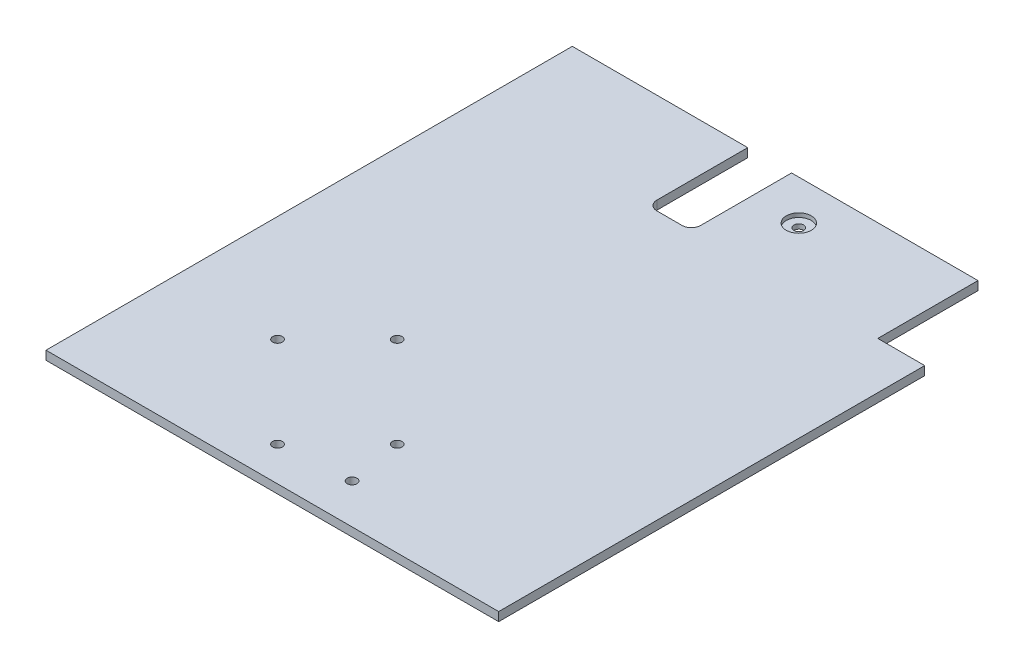
ISO-10303-21;
HEADER;
FILE_DESCRIPTION(('STEP AP214'),'2;1');
FILE_NAME('part.step','',(''),(''),'','','');
FILE_SCHEMA(('AUTOMOTIVE_DESIGN { 1 0 10303 214 1 1 1 1 }'));
ENDSEC;
DATA;
#1=APPLICATION_CONTEXT('core data for automotive mechanical design processes');
#2=APPLICATION_PROTOCOL_DEFINITION('international standard','automotive_design',2000,#1);
#3=PRODUCT_CONTEXT('',#1,'mechanical');
#4=PRODUCT('Part','Part','',(#3));
#5=PRODUCT_RELATED_PRODUCT_CATEGORY('part','',(#4));
#6=PRODUCT_DEFINITION_FORMATION('','',#4);
#7=PRODUCT_DEFINITION_CONTEXT('part definition',#1,'design');
#8=PRODUCT_DEFINITION('design','',#6,#7);
#9=PRODUCT_DEFINITION_SHAPE('','',#8);
#10=(LENGTH_UNIT() NAMED_UNIT(*) SI_UNIT(.MILLI.,.METRE.));
#11=(NAMED_UNIT(*) PLANE_ANGLE_UNIT() SI_UNIT($,.RADIAN.));
#12=(NAMED_UNIT(*) SI_UNIT($,.STERADIAN.) SOLID_ANGLE_UNIT());
#13=UNCERTAINTY_MEASURE_WITH_UNIT(LENGTH_MEASURE(1.E-05),#10,'distance_accuracy_value','');
#14=(GEOMETRIC_REPRESENTATION_CONTEXT(3) GLOBAL_UNCERTAINTY_ASSIGNED_CONTEXT((#13)) GLOBAL_UNIT_ASSIGNED_CONTEXT((#10,
#11,#12)) REPRESENTATION_CONTEXT('',''));
#15=CARTESIAN_POINT('',(0.,0.,0.));
#16=DIRECTION('',(0.,0.,1.));
#17=DIRECTION('',(1.,0.,0.));
#18=AXIS2_PLACEMENT_3D('',#15,#16,#17);
#19=CARTESIAN_POINT('',(-72.25,2.8,-84.));
#20=DIRECTION('',(0.,0.,1.));
#21=DIRECTION('',(1.,0.,0.));
#22=AXIS2_PLACEMENT_3D('',#19,#20,#21);
#23=PLANE('',#22);
#24=DIRECTION('',(-1.,0.,0.));
#25=VECTOR('',#24,1.);
#26=CARTESIAN_POINT('',(-72.25,0.,-84.));
#27=LINE('',#26,#25);
#28=CARTESIAN_POINT('',(57.25,0.,-84.));
#29=VERTEX_POINT('',#28);
#30=CARTESIAN_POINT('',(-2.24999999999999,0.,-84.));
#31=VERTEX_POINT('',#30);
#32=EDGE_CURVE('E141',#29,#31,#27,.T.);
#33=ORIENTED_EDGE('',*,*,#32,.T.);
#34=DIRECTION('',(0.,1.,0.));
#35=VECTOR('',#34,1.);
#36=CARTESIAN_POINT('',(-2.24999999999999,-0.00100000000000013,-84.));
#37=LINE('',#36,#35);
#38=CARTESIAN_POINT('',(-2.24999999999999,2.8,-84.));
#39=VERTEX_POINT('',#38);
#40=EDGE_CURVE('E121',#31,#39,#37,.T.);
#41=ORIENTED_EDGE('',*,*,#40,.T.);
#42=DIRECTION('',(-1.,0.,0.));
#43=VECTOR('',#42,1.);
#44=CARTESIAN_POINT('',(-72.25,2.8,-84.));
#45=LINE('',#44,#43);
#46=CARTESIAN_POINT('',(57.25,2.8,-84.));
#47=VERTEX_POINT('',#46);
#48=EDGE_CURVE('E213',#47,#39,#45,.T.);
#49=ORIENTED_EDGE('',*,*,#48,.F.);
#50=DIRECTION('',(0.,1.,0.));
#51=VECTOR('',#50,1.);
#52=CARTESIAN_POINT('',(57.25,-0.00100000000000013,-84.));
#53=LINE('',#52,#51);
#54=EDGE_CURVE('E147',#29,#47,#53,.T.);
#55=ORIENTED_EDGE('',*,*,#54,.F.);
#56=EDGE_LOOP('',(#33,#41,#49,#55));
#57=FACE_BOUND('',#56,.T.);
#58=ADVANCED_FACE('F32',(#57),#23,.F.);
#59=CARTESIAN_POINT('',(12.75,-0.00100000000000013,-71.3));
#60=DIRECTION('',(0.,1.,0.));
#61=DIRECTION('',(0.,0.,1.));
#62=AXIS2_PLACEMENT_3D('',#59,#60,#61);
#63=CYLINDRICAL_SURFACE('',#62,1.54999999999999);
#64=CARTESIAN_POINT('',(12.75,0.,-71.3));
#65=DIRECTION('',(0.,-1.,0.));
#66=DIRECTION('',(0.,0.,-1.));
#67=AXIS2_PLACEMENT_3D('',#64,#65,#66);
#68=CIRCLE('',#67,1.54999999999999);
#69=CARTESIAN_POINT('',(12.75,0.,-72.85));
#70=VERTEX_POINT('',#69);
#71=EDGE_CURVE('E197',#70,#70,#68,.F.);
#72=ORIENTED_EDGE('',*,*,#71,.F.);
#73=EDGE_LOOP('',(#72));
#74=FACE_BOUND('',#73,.T.);
#75=CARTESIAN_POINT('',(12.75,1.5,-71.3));
#76=DIRECTION('',(0.,1.,0.));
#77=DIRECTION('',(0.,0.,1.));
#78=AXIS2_PLACEMENT_3D('',#75,#76,#77);
#79=CIRCLE('',#78,1.54999999999999);
#80=CARTESIAN_POINT('',(12.75,1.5,-69.75));
#81=VERTEX_POINT('',#80);
#82=EDGE_CURVE('E36',#81,#81,#79,.F.);
#83=ORIENTED_EDGE('',*,*,#82,.F.);
#84=EDGE_LOOP('',(#83));
#85=FACE_BOUND('',#84,.T.);
#86=ADVANCED_FACE('F296',(#74,#85),#63,.F.);
#87=CARTESIAN_POINT('',(72.25,2.8,84.));
#88=DIRECTION('',(-1.,0.,0.));
#89=DIRECTION('',(0.,0.,1.));
#90=AXIS2_PLACEMENT_3D('',#87,#88,#89);
#91=PLANE('',#90);
#92=DIRECTION('',(0.,0.,-1.));
#93=VECTOR('',#92,1.);
#94=CARTESIAN_POINT('',(72.25,0.,84.));
#95=LINE('',#94,#93);
#96=CARTESIAN_POINT('',(72.25,0.,84.));
#97=VERTEX_POINT('',#96);
#98=CARTESIAN_POINT('',(72.25,0.,-52.));
#99=VERTEX_POINT('',#98);
#100=EDGE_CURVE('E153',#97,#99,#95,.T.);
#101=ORIENTED_EDGE('',*,*,#100,.T.);
#102=DIRECTION('',(0.,1.,0.));
#103=VECTOR('',#102,1.);
#104=CARTESIAN_POINT('',(72.25,-0.00100000000000013,-52.));
#105=LINE('',#104,#103);
#106=CARTESIAN_POINT('',(72.25,2.8,-52.));
#107=VERTEX_POINT('',#106);
#108=EDGE_CURVE('E56',#99,#107,#105,.T.);
#109=ORIENTED_EDGE('',*,*,#108,.T.);
#110=DIRECTION('',(0.,0.,-1.));
#111=VECTOR('',#110,1.);
#112=CARTESIAN_POINT('',(72.25,2.8,84.));
#113=LINE('',#112,#111);
#114=CARTESIAN_POINT('',(72.25,2.8,84.));
#115=VERTEX_POINT('',#114);
#116=EDGE_CURVE('E158',#115,#107,#113,.T.);
#117=ORIENTED_EDGE('',*,*,#116,.F.);
#118=DIRECTION('',(0.,-1.,0.));
#119=VECTOR('',#118,1.);
#120=CARTESIAN_POINT('',(72.25,2.8,84.));
#121=LINE('',#120,#119);
#122=EDGE_CURVE('E159',#115,#97,#121,.T.);
#123=ORIENTED_EDGE('',*,*,#122,.T.);
#124=EDGE_LOOP('',(#101,#109,#117,#123));
#125=FACE_BOUND('',#124,.T.);
#126=ADVANCED_FACE('F34',(#125),#91,.F.);
#127=CARTESIAN_POINT('',(-16.25,2.8,-84.));
#128=VERTEX_POINT('',#127);
#129=CARTESIAN_POINT('',(-72.25,2.8,-84.));
#130=VERTEX_POINT('',#129);
#131=EDGE_CURVE('E212',#128,#130,#45,.T.);
#132=ORIENTED_EDGE('',*,*,#131,.F.);
#133=DIRECTION('',(0.,1.,0.));
#134=VECTOR('',#133,1.);
#135=CARTESIAN_POINT('',(-16.25,-0.00100000000000013,-84.));
#136=LINE('',#135,#134);
#137=CARTESIAN_POINT('',(-16.25,0.,-84.));
#138=VERTEX_POINT('',#137);
#139=EDGE_CURVE('E243',#138,#128,#136,.T.);
#140=ORIENTED_EDGE('',*,*,#139,.F.);
#141=CARTESIAN_POINT('',(-72.25,0.,-84.));
#142=VERTEX_POINT('',#141);
#143=EDGE_CURVE('E149',#138,#142,#27,.T.);
#144=ORIENTED_EDGE('',*,*,#143,.T.);
#145=DIRECTION('',(0.,-1.,0.));
#146=VECTOR('',#145,1.);
#147=CARTESIAN_POINT('',(-72.25,2.8,-84.));
#148=LINE('',#147,#146);
#149=EDGE_CURVE('E11',#130,#142,#148,.T.);
#150=ORIENTED_EDGE('',*,*,#149,.F.);
#151=EDGE_LOOP('',(#132,#140,#144,#150));
#152=FACE_BOUND('',#151,.T.);
#153=ADVANCED_FACE('F297',(#152),#23,.F.);
#154=CARTESIAN_POINT('',(-72.25,2.8,84.));
#155=DIRECTION('',(1.,0.,0.));
#156=DIRECTION('',(0.,0.,-1.));
#157=AXIS2_PLACEMENT_3D('',#154,#155,#156);
#158=PLANE('',#157);
#159=DIRECTION('',(0.,0.,1.));
#160=VECTOR('',#159,1.);
#161=CARTESIAN_POINT('',(-72.25,0.,84.));
#162=LINE('',#161,#160);
#163=CARTESIAN_POINT('',(-72.25,0.,84.));
#164=VERTEX_POINT('',#163);
#165=EDGE_CURVE('E148',#142,#164,#162,.T.);
#166=ORIENTED_EDGE('',*,*,#165,.T.);
#167=DIRECTION('',(0.,-1.,0.));
#168=VECTOR('',#167,1.);
#169=CARTESIAN_POINT('',(-72.25,2.8,84.));
#170=LINE('',#169,#168);
#171=CARTESIAN_POINT('',(-72.25,2.8,84.));
#172=VERTEX_POINT('',#171);
#173=EDGE_CURVE('E41',#172,#164,#170,.T.);
#174=ORIENTED_EDGE('',*,*,#173,.F.);
#175=DIRECTION('',(0.,0.,1.));
#176=VECTOR('',#175,1.);
#177=CARTESIAN_POINT('',(-72.25,2.8,84.));
#178=LINE('',#177,#176);
#179=EDGE_CURVE('E215',#130,#172,#178,.T.);
#180=ORIENTED_EDGE('',*,*,#179,.F.);
#181=ORIENTED_EDGE('',*,*,#149,.T.);
#182=EDGE_LOOP('',(#166,#174,#180,#181));
#183=FACE_BOUND('',#182,.T.);
#184=ADVANCED_FACE('F305',(#183),#158,.F.);
#185=CARTESIAN_POINT('',(-72.25,2.8,84.));
#186=DIRECTION('',(0.,0.,-1.));
#187=DIRECTION('',(-1.,0.,0.));
#188=AXIS2_PLACEMENT_3D('',#185,#186,#187);
#189=PLANE('',#188);
#190=DIRECTION('',(1.,0.,0.));
#191=VECTOR('',#190,1.);
#192=CARTESIAN_POINT('',(-72.25,0.,84.));
#193=LINE('',#192,#191);
#194=EDGE_CURVE('E151',#164,#97,#193,.T.);
#195=ORIENTED_EDGE('',*,*,#194,.T.);
#196=ORIENTED_EDGE('',*,*,#122,.F.);
#197=DIRECTION('',(1.,0.,0.));
#198=VECTOR('',#197,1.);
#199=CARTESIAN_POINT('',(-72.25,2.8,84.));
#200=LINE('',#199,#198);
#201=EDGE_CURVE('E162',#172,#115,#200,.T.);
#202=ORIENTED_EDGE('',*,*,#201,.F.);
#203=ORIENTED_EDGE('',*,*,#173,.T.);
#204=EDGE_LOOP('',(#195,#196,#202,#203));
#205=FACE_BOUND('',#204,.T.);
#206=ADVANCED_FACE('F168',(#205),#189,.F.);
#207=CARTESIAN_POINT('',(0.,2.8,0.));
#208=DIRECTION('',(0.,-1.,0.));
#209=DIRECTION('',(0.,0.,-1.));
#210=AXIS2_PLACEMENT_3D('',#207,#208,#209);
#211=PLANE('',#210);
#212=CARTESIAN_POINT('',(12.75,2.8,-71.3));
#213=DIRECTION('',(0.,1.,0.));
#214=DIRECTION('',(0.,0.,1.));
#215=AXIS2_PLACEMENT_3D('',#212,#213,#214);
#216=CIRCLE('',#215,4.);
#217=CARTESIAN_POINT('',(12.75,2.8,-67.3));
#218=VERTEX_POINT('',#217);
#219=EDGE_CURVE('E235',#218,#218,#216,.T.);
#220=ORIENTED_EDGE('',*,*,#219,.F.);
#221=EDGE_LOOP('',(#220));
#222=FACE_BOUND('',#221,.T.);
#223=CARTESIAN_POINT('',(12.75,2.8,71.3));
#224=DIRECTION('',(0.,1.,0.));
#225=DIRECTION('',(0.,0.,1.));
#226=AXIS2_PLACEMENT_3D('',#223,#224,#225);
#227=CIRCLE('',#226,1.54999999999999);
#228=CARTESIAN_POINT('',(12.75,2.8,72.85));
#229=VERTEX_POINT('',#228);
#230=EDGE_CURVE('E230',#229,#229,#227,.T.);
#231=ORIENTED_EDGE('',*,*,#230,.F.);
#232=EDGE_LOOP('',(#231));
#233=FACE_BOUND('',#232,.T.);
#234=CARTESIAN_POINT('',(-38.2916305603427,2.8,44.0502525316942));
#235=DIRECTION('',(0.,1.,0.));
#236=DIRECTION('',(0.,0.,1.));
#237=AXIS2_PLACEMENT_3D('',#234,#235,#236);
#238=CIRCLE('',#237,1.55);
#239=CARTESIAN_POINT('',(-38.2916305603427,2.8,45.6002525316942));
#240=VERTEX_POINT('',#239);
#241=EDGE_CURVE('E191',#240,#240,#238,.T.);
#242=ORIENTED_EDGE('',*,*,#241,.F.);
#243=EDGE_LOOP('',(#242));
#244=FACE_BOUND('',#243,.T.);
#245=CARTESIAN_POINT('',(-9.30025253169415,2.8,73.0416305603426));
#246=DIRECTION('',(0.,1.,0.));
#247=DIRECTION('',(0.,0.,1.));
#248=AXIS2_PLACEMENT_3D('',#245,#246,#247);
#249=CIRCLE('',#248,1.55);
#250=CARTESIAN_POINT('',(-9.30025253169415,2.8,74.5916305603426));
#251=VERTEX_POINT('',#250);
#252=EDGE_CURVE('E184',#251,#251,#249,.T.);
#253=ORIENTED_EDGE('',*,*,#252,.F.);
#254=EDGE_LOOP('',(#253));
#255=FACE_BOUND('',#254,.T.);
#256=CARTESIAN_POINT('',(-19.1997474683059,2.8,24.9583694396574));
#257=DIRECTION('',(0.,1.,0.));
#258=DIRECTION('',(0.,0.,1.));
#259=AXIS2_PLACEMENT_3D('',#256,#257,#258);
#260=CIRCLE('',#259,1.55);
#261=CARTESIAN_POINT('',(-19.1997474683059,2.8,26.5083694396574));
#262=VERTEX_POINT('',#261);
#263=EDGE_CURVE('E205',#262,#262,#260,.T.);
#264=ORIENTED_EDGE('',*,*,#263,.F.);
#265=EDGE_LOOP('',(#264));
#266=FACE_BOUND('',#265,.T.);
#267=CARTESIAN_POINT('',(9.79163056034259,2.8,53.9497474683058));
#268=DIRECTION('',(0.,1.,0.));
#269=DIRECTION('',(0.,0.,1.));
#270=AXIS2_PLACEMENT_3D('',#267,#268,#269);
#271=CIRCLE('',#270,1.55000000000001);
#272=CARTESIAN_POINT('',(9.79163056034259,2.8,55.4997474683058));
#273=VERTEX_POINT('',#272);
#274=EDGE_CURVE('E198',#273,#273,#271,.T.);
#275=ORIENTED_EDGE('',*,*,#274,.F.);
#276=EDGE_LOOP('',(#275));
#277=FACE_BOUND('',#276,.T.);
#278=ORIENTED_EDGE('',*,*,#48,.T.);
#279=DIRECTION('',(0.,0.,-1.));
#280=VECTOR('',#279,1.);
#281=CARTESIAN_POINT('',(-2.24999999999999,2.8,-55.));
#282=LINE('',#281,#280);
#283=CARTESIAN_POINT('',(-2.24999999999999,2.8,-55.));
#284=VERTEX_POINT('',#283);
#285=EDGE_CURVE('E127',#284,#39,#282,.T.);
#286=ORIENTED_EDGE('',*,*,#285,.F.);
#287=CARTESIAN_POINT('',(-5.24999999999999,2.8,-55.));
#288=DIRECTION('',(0.,1.,0.));
#289=DIRECTION('',(0.,0.,-1.));
#290=AXIS2_PLACEMENT_3D('',#287,#288,#289);
#291=CIRCLE('',#290,3.);
#292=CARTESIAN_POINT('',(-5.24999999999999,2.8,-52.));
#293=VERTEX_POINT('',#292);
#294=EDGE_CURVE('E252',#293,#284,#291,.T.);
#295=ORIENTED_EDGE('',*,*,#294,.F.);
#296=DIRECTION('',(1.,0.,0.));
#297=VECTOR('',#296,1.);
#298=CARTESIAN_POINT('',(-13.25,2.8,-52.));
#299=LINE('',#298,#297);
#300=CARTESIAN_POINT('',(-13.25,2.8,-52.));
#301=VERTEX_POINT('',#300);
#302=EDGE_CURVE('E255',#301,#293,#299,.T.);
#303=ORIENTED_EDGE('',*,*,#302,.F.);
#304=CARTESIAN_POINT('',(-13.25,2.8,-55.));
#305=DIRECTION('',(0.,1.,0.));
#306=DIRECTION('',(0.,0.,-1.));
#307=AXIS2_PLACEMENT_3D('',#304,#305,#306);
#308=CIRCLE('',#307,3.);
#309=CARTESIAN_POINT('',(-16.25,2.8,-55.));
#310=VERTEX_POINT('',#309);
#311=EDGE_CURVE('E258',#310,#301,#308,.T.);
#312=ORIENTED_EDGE('',*,*,#311,.F.);
#313=DIRECTION('',(0.,0.,1.));
#314=VECTOR('',#313,1.);
#315=CARTESIAN_POINT('',(-16.25,2.8,-84.));
#316=LINE('',#315,#314);
#317=EDGE_CURVE('E144',#128,#310,#316,.T.);
#318=ORIENTED_EDGE('',*,*,#317,.F.);
#319=ORIENTED_EDGE('',*,*,#131,.T.);
#320=ORIENTED_EDGE('',*,*,#179,.T.);
#321=ORIENTED_EDGE('',*,*,#201,.T.);
#322=ORIENTED_EDGE('',*,*,#116,.T.);
#323=DIRECTION('',(1.,0.,0.));
#324=VECTOR('',#323,1.);
#325=CARTESIAN_POINT('',(57.25,2.8,-52.));
#326=LINE('',#325,#324);
#327=CARTESIAN_POINT('',(57.25,2.8,-52.));
#328=VERTEX_POINT('',#327);
#329=EDGE_CURVE('E220',#328,#107,#326,.T.);
#330=ORIENTED_EDGE('',*,*,#329,.F.);
#331=DIRECTION('',(0.,0.,1.));
#332=VECTOR('',#331,1.);
#333=CARTESIAN_POINT('',(57.25,2.8,-84.));
#334=LINE('',#333,#332);
#335=EDGE_CURVE('E223',#47,#328,#334,.T.);
#336=ORIENTED_EDGE('',*,*,#335,.F.);
#337=EDGE_LOOP('',(#278,#286,#295,#303,#312,#318,#319,#320,#321,#322,#330,#336));
#338=FACE_BOUND('',#337,.T.);
#339=ADVANCED_FACE('F217',(#222,#233,#244,#255,#266,#277,#338),#211,.F.);
#340=CARTESIAN_POINT('',(0.,0.,0.));
#341=DIRECTION('',(0.,-1.,0.));
#342=DIRECTION('',(0.,0.,-1.));
#343=AXIS2_PLACEMENT_3D('',#340,#341,#342);
#344=PLANE('',#343);
#345=DIRECTION('',(0.,0.,-1.));
#346=VECTOR('',#345,1.);
#347=CARTESIAN_POINT('',(-2.24999999999999,0.,-55.));
#348=LINE('',#347,#346);
#349=CARTESIAN_POINT('',(-2.24999999999999,0.,-55.));
#350=VERTEX_POINT('',#349);
#351=EDGE_CURVE('E124',#350,#31,#348,.T.);
#352=ORIENTED_EDGE('',*,*,#351,.T.);
#353=ORIENTED_EDGE('',*,*,#32,.F.);
#354=DIRECTION('',(0.,0.,1.));
#355=VECTOR('',#354,1.);
#356=CARTESIAN_POINT('',(57.25,0.,-84.));
#357=LINE('',#356,#355);
#358=CARTESIAN_POINT('',(57.25,0.,-52.));
#359=VERTEX_POINT('',#358);
#360=EDGE_CURVE('E201',#29,#359,#357,.T.);
#361=ORIENTED_EDGE('',*,*,#360,.T.);
#362=DIRECTION('',(1.,0.,0.));
#363=VECTOR('',#362,1.);
#364=CARTESIAN_POINT('',(57.25,0.,-52.));
#365=LINE('',#364,#363);
#366=EDGE_CURVE('E176',#359,#99,#365,.T.);
#367=ORIENTED_EDGE('',*,*,#366,.T.);
#368=ORIENTED_EDGE('',*,*,#100,.F.);
#369=ORIENTED_EDGE('',*,*,#194,.F.);
#370=ORIENTED_EDGE('',*,*,#165,.F.);
#371=ORIENTED_EDGE('',*,*,#143,.F.);
#372=DIRECTION('',(0.,0.,1.));
#373=VECTOR('',#372,1.);
#374=CARTESIAN_POINT('',(-16.25,0.,-84.));
#375=LINE('',#374,#373);
#376=CARTESIAN_POINT('',(-16.25,0.,-55.));
#377=VERTEX_POINT('',#376);
#378=EDGE_CURVE('E132',#138,#377,#375,.T.);
#379=ORIENTED_EDGE('',*,*,#378,.T.);
#380=CARTESIAN_POINT('',(-13.25,0.,-55.));
#381=DIRECTION('',(0.,-1.,0.));
#382=DIRECTION('',(0.,0.,-1.));
#383=AXIS2_PLACEMENT_3D('',#380,#381,#382);
#384=CIRCLE('',#383,3.);
#385=CARTESIAN_POINT('',(-13.25,0.,-52.));
#386=VERTEX_POINT('',#385);
#387=EDGE_CURVE('E265',#377,#386,#384,.F.);
#388=ORIENTED_EDGE('',*,*,#387,.T.);
#389=DIRECTION('',(1.,0.,0.));
#390=VECTOR('',#389,1.);
#391=CARTESIAN_POINT('',(-13.25,0.,-52.));
#392=LINE('',#391,#390);
#393=CARTESIAN_POINT('',(-5.24999999999999,0.,-52.));
#394=VERTEX_POINT('',#393);
#395=EDGE_CURVE('E263',#386,#394,#392,.T.);
#396=ORIENTED_EDGE('',*,*,#395,.T.);
#397=CARTESIAN_POINT('',(-5.24999999999999,0.,-55.));
#398=DIRECTION('',(0.,-1.,0.));
#399=DIRECTION('',(0.,0.,-1.));
#400=AXIS2_PLACEMENT_3D('',#397,#398,#399);
#401=CIRCLE('',#400,3.);
#402=EDGE_CURVE('E143',#394,#350,#401,.F.);
#403=ORIENTED_EDGE('',*,*,#402,.T.);
#404=EDGE_LOOP('',(#352,#353,#361,#367,#368,#369,#370,#371,#379,#388,#396,#403));
#405=FACE_BOUND('',#404,.T.);
#406=ORIENTED_EDGE('',*,*,#71,.T.);
#407=EDGE_LOOP('',(#406));
#408=FACE_BOUND('',#407,.T.);
#409=CARTESIAN_POINT('',(12.75,0.,71.3));
#410=DIRECTION('',(0.,-1.,0.));
#411=DIRECTION('',(0.,0.,-1.));
#412=AXIS2_PLACEMENT_3D('',#409,#410,#411);
#413=CIRCLE('',#412,1.54999999999999);
#414=CARTESIAN_POINT('',(12.75,0.,69.75));
#415=VERTEX_POINT('',#414);
#416=EDGE_CURVE('E227',#415,#415,#413,.F.);
#417=ORIENTED_EDGE('',*,*,#416,.T.);
#418=EDGE_LOOP('',(#417));
#419=FACE_BOUND('',#418,.T.);
#420=CARTESIAN_POINT('',(-38.2916305603427,0.,44.0502525316942));
#421=DIRECTION('',(0.,-1.,0.));
#422=DIRECTION('',(0.,0.,-1.));
#423=AXIS2_PLACEMENT_3D('',#420,#421,#422);
#424=CIRCLE('',#423,1.55);
#425=CARTESIAN_POINT('',(-38.2916305603427,0.,42.5002525316942));
#426=VERTEX_POINT('',#425);
#427=EDGE_CURVE('E194',#426,#426,#424,.F.);
#428=ORIENTED_EDGE('',*,*,#427,.T.);
#429=EDGE_LOOP('',(#428));
#430=FACE_BOUND('',#429,.T.);
#431=CARTESIAN_POINT('',(-9.30025253169415,0.,73.0416305603426));
#432=DIRECTION('',(0.,-1.,0.));
#433=DIRECTION('',(0.,0.,-1.));
#434=AXIS2_PLACEMENT_3D('',#431,#432,#433);
#435=CIRCLE('',#434,1.55);
#436=CARTESIAN_POINT('',(-9.30025253169415,0.,71.4916305603426));
#437=VERTEX_POINT('',#436);
#438=EDGE_CURVE('E188',#437,#437,#435,.F.);
#439=ORIENTED_EDGE('',*,*,#438,.T.);
#440=EDGE_LOOP('',(#439));
#441=FACE_BOUND('',#440,.T.);
#442=CARTESIAN_POINT('',(-19.1997474683059,0.,24.9583694396574));
#443=DIRECTION('',(0.,-1.,0.));
#444=DIRECTION('',(0.,0.,-1.));
#445=AXIS2_PLACEMENT_3D('',#442,#443,#444);
#446=CIRCLE('',#445,1.55);
#447=CARTESIAN_POINT('',(-19.1997474683059,0.,23.4083694396574));
#448=VERTEX_POINT('',#447);
#449=EDGE_CURVE('E187',#448,#448,#446,.F.);
#450=ORIENTED_EDGE('',*,*,#449,.T.);
#451=EDGE_LOOP('',(#450));
#452=FACE_BOUND('',#451,.T.);
#453=CARTESIAN_POINT('',(9.79163056034259,0.,53.9497474683058));
#454=DIRECTION('',(0.,-1.,0.));
#455=DIRECTION('',(0.,0.,-1.));
#456=AXIS2_PLACEMENT_3D('',#453,#454,#455);
#457=CIRCLE('',#456,1.55000000000001);
#458=CARTESIAN_POINT('',(9.79163056034259,0.,52.3997474683058));
#459=VERTEX_POINT('',#458);
#460=EDGE_CURVE('E202',#459,#459,#457,.F.);
#461=ORIENTED_EDGE('',*,*,#460,.T.);
#462=EDGE_LOOP('',(#461));
#463=FACE_BOUND('',#462,.T.);
#464=ADVANCED_FACE('F138',(#405,#408,#419,#430,#441,#452,#463),#344,.T.);
#465=CARTESIAN_POINT('',(9.79163056034259,-0.00100000000000013,53.9497474683058));
#466=DIRECTION('',(0.,1.,0.));
#467=DIRECTION('',(0.,0.,1.));
#468=AXIS2_PLACEMENT_3D('',#465,#466,#467);
#469=CYLINDRICAL_SURFACE('',#468,1.55000000000001);
#470=ORIENTED_EDGE('',*,*,#460,.F.);
#471=EDGE_LOOP('',(#470));
#472=FACE_BOUND('',#471,.T.);
#473=ORIENTED_EDGE('',*,*,#274,.T.);
#474=EDGE_LOOP('',(#473));
#475=FACE_BOUND('',#474,.T.);
#476=ADVANCED_FACE('F351',(#472,#475),#469,.F.);
#477=CARTESIAN_POINT('',(-19.1997474683059,-0.00100000000000013,24.9583694396574));
#478=DIRECTION('',(0.,1.,0.));
#479=DIRECTION('',(0.,0.,1.));
#480=AXIS2_PLACEMENT_3D('',#477,#478,#479);
#481=CYLINDRICAL_SURFACE('',#480,1.55);
#482=ORIENTED_EDGE('',*,*,#449,.F.);
#483=EDGE_LOOP('',(#482));
#484=FACE_BOUND('',#483,.T.);
#485=ORIENTED_EDGE('',*,*,#263,.T.);
#486=EDGE_LOOP('',(#485));
#487=FACE_BOUND('',#486,.T.);
#488=ADVANCED_FACE('F353',(#484,#487),#481,.F.);
#489=CARTESIAN_POINT('',(-9.30025253169415,-0.00100000000000013,73.0416305603426));
#490=DIRECTION('',(0.,1.,0.));
#491=DIRECTION('',(0.,0.,1.));
#492=AXIS2_PLACEMENT_3D('',#489,#490,#491);
#493=CYLINDRICAL_SURFACE('',#492,1.55);
#494=ORIENTED_EDGE('',*,*,#438,.F.);
#495=EDGE_LOOP('',(#494));
#496=FACE_BOUND('',#495,.T.);
#497=ORIENTED_EDGE('',*,*,#252,.T.);
#498=EDGE_LOOP('',(#497));
#499=FACE_BOUND('',#498,.T.);
#500=ADVANCED_FACE('F360',(#496,#499),#493,.F.);
#501=CARTESIAN_POINT('',(-38.2916305603427,-0.00100000000000013,44.0502525316942));
#502=DIRECTION('',(0.,1.,0.));
#503=DIRECTION('',(0.,0.,1.));
#504=AXIS2_PLACEMENT_3D('',#501,#502,#503);
#505=CYLINDRICAL_SURFACE('',#504,1.55);
#506=ORIENTED_EDGE('',*,*,#427,.F.);
#507=EDGE_LOOP('',(#506));
#508=FACE_BOUND('',#507,.T.);
#509=ORIENTED_EDGE('',*,*,#241,.T.);
#510=EDGE_LOOP('',(#509));
#511=FACE_BOUND('',#510,.T.);
#512=ADVANCED_FACE('F293',(#508,#511),#505,.F.);
#513=CARTESIAN_POINT('',(57.25,-0.00100000000000013,-84.));
#514=DIRECTION('',(-1.,0.,0.));
#515=DIRECTION('',(0.,0.,1.));
#516=AXIS2_PLACEMENT_3D('',#513,#514,#515);
#517=PLANE('',#516);
#518=ORIENTED_EDGE('',*,*,#54,.T.);
#519=ORIENTED_EDGE('',*,*,#335,.T.);
#520=DIRECTION('',(0.,1.,0.));
#521=VECTOR('',#520,1.);
#522=CARTESIAN_POINT('',(57.25,-0.00100000000000013,-52.));
#523=LINE('',#522,#521);
#524=EDGE_CURVE('E182',#359,#328,#523,.T.);
#525=ORIENTED_EDGE('',*,*,#524,.F.);
#526=ORIENTED_EDGE('',*,*,#360,.F.);
#527=EDGE_LOOP('',(#518,#519,#525,#526));
#528=FACE_BOUND('',#527,.T.);
#529=ADVANCED_FACE('F281',(#528),#517,.F.);
#530=CARTESIAN_POINT('',(57.25,-0.00100000000000013,-52.));
#531=DIRECTION('',(0.,0.,1.));
#532=DIRECTION('',(1.,0.,0.));
#533=AXIS2_PLACEMENT_3D('',#530,#531,#532);
#534=PLANE('',#533);
#535=ORIENTED_EDGE('',*,*,#524,.T.);
#536=ORIENTED_EDGE('',*,*,#329,.T.);
#537=ORIENTED_EDGE('',*,*,#108,.F.);
#538=ORIENTED_EDGE('',*,*,#366,.F.);
#539=EDGE_LOOP('',(#535,#536,#537,#538));
#540=FACE_BOUND('',#539,.T.);
#541=ADVANCED_FACE('F282',(#540),#534,.F.);
#542=CARTESIAN_POINT('',(12.75,-0.00100000000000013,71.3));
#543=DIRECTION('',(0.,1.,0.));
#544=DIRECTION('',(0.,0.,1.));
#545=AXIS2_PLACEMENT_3D('',#542,#543,#544);
#546=CYLINDRICAL_SURFACE('',#545,1.54999999999999);
#547=ORIENTED_EDGE('',*,*,#416,.F.);
#548=EDGE_LOOP('',(#547));
#549=FACE_BOUND('',#548,.T.);
#550=ORIENTED_EDGE('',*,*,#230,.T.);
#551=EDGE_LOOP('',(#550));
#552=FACE_BOUND('',#551,.T.);
#553=ADVANCED_FACE('F284',(#549,#552),#546,.F.);
#554=CARTESIAN_POINT('',(12.75,1.5,-71.3));
#555=DIRECTION('',(0.,1.,0.));
#556=DIRECTION('',(0.,0.,1.));
#557=AXIS2_PLACEMENT_3D('',#554,#555,#556);
#558=PLANE('',#557);
#559=CARTESIAN_POINT('',(12.75,1.5,-71.3));
#560=DIRECTION('',(0.,1.,0.));
#561=DIRECTION('',(0.,0.,1.));
#562=AXIS2_PLACEMENT_3D('',#559,#560,#561);
#563=CIRCLE('',#562,4.);
#564=CARTESIAN_POINT('',(12.75,1.5,-67.3));
#565=VERTEX_POINT('',#564);
#566=EDGE_CURVE('E238',#565,#565,#563,.T.);
#567=ORIENTED_EDGE('',*,*,#566,.T.);
#568=EDGE_LOOP('',(#567));
#569=FACE_BOUND('',#568,.T.);
#570=ORIENTED_EDGE('',*,*,#82,.T.);
#571=EDGE_LOOP('',(#570));
#572=FACE_BOUND('',#571,.T.);
#573=ADVANCED_FACE('F290',(#569,#572),#558,.T.);
#574=CARTESIAN_POINT('',(12.75,1.5,-71.3));
#575=DIRECTION('',(0.,1.,0.));
#576=DIRECTION('',(0.,0.,1.));
#577=AXIS2_PLACEMENT_3D('',#574,#575,#576);
#578=CYLINDRICAL_SURFACE('',#577,4.);
#579=ORIENTED_EDGE('',*,*,#566,.F.);
#580=EDGE_LOOP('',(#579));
#581=FACE_BOUND('',#580,.T.);
#582=ORIENTED_EDGE('',*,*,#219,.T.);
#583=EDGE_LOOP('',(#582));
#584=FACE_BOUND('',#583,.T.);
#585=ADVANCED_FACE('F326',(#581,#584),#578,.F.);
#586=CARTESIAN_POINT('',(-2.24999999999999,-0.00100000000000013,-55.));
#587=DIRECTION('',(1.,0.,0.));
#588=DIRECTION('',(0.,0.,-1.));
#589=AXIS2_PLACEMENT_3D('',#586,#587,#588);
#590=PLANE('',#589);
#591=DIRECTION('',(0.,1.,0.));
#592=VECTOR('',#591,1.);
#593=CARTESIAN_POINT('',(-2.24999999999999,-0.00100000000000013,-55.));
#594=LINE('',#593,#592);
#595=EDGE_CURVE('E133',#350,#284,#594,.T.);
#596=ORIENTED_EDGE('',*,*,#595,.T.);
#597=ORIENTED_EDGE('',*,*,#285,.T.);
#598=ORIENTED_EDGE('',*,*,#40,.F.);
#599=ORIENTED_EDGE('',*,*,#351,.F.);
#600=EDGE_LOOP('',(#596,#597,#598,#599));
#601=FACE_BOUND('',#600,.T.);
#602=ADVANCED_FACE('F123',(#601),#590,.F.);
#603=CARTESIAN_POINT('',(-5.24999999999999,-0.00100000000000013,-55.));
#604=DIRECTION('',(0.,1.,0.));
#605=DIRECTION('',(0.,0.,1.));
#606=AXIS2_PLACEMENT_3D('',#603,#604,#605);
#607=CYLINDRICAL_SURFACE('',#606,3.);
#608=DIRECTION('',(0.,1.,0.));
#609=VECTOR('',#608,1.);
#610=CARTESIAN_POINT('',(-5.24999999999999,-0.00100000000000013,-52.));
#611=LINE('',#610,#609);
#612=EDGE_CURVE('E248',#394,#293,#611,.T.);
#613=ORIENTED_EDGE('',*,*,#612,.T.);
#614=ORIENTED_EDGE('',*,*,#294,.T.);
#615=ORIENTED_EDGE('',*,*,#595,.F.);
#616=ORIENTED_EDGE('',*,*,#402,.F.);
#617=EDGE_LOOP('',(#613,#614,#615,#616));
#618=FACE_BOUND('',#617,.T.);
#619=ADVANCED_FACE('F277',(#618),#607,.F.);
#620=CARTESIAN_POINT('',(-13.25,-0.00100000000000013,-52.));
#621=DIRECTION('',(0.,0.,1.));
#622=DIRECTION('',(1.,0.,0.));
#623=AXIS2_PLACEMENT_3D('',#620,#621,#622);
#624=PLANE('',#623);
#625=DIRECTION('',(0.,1.,0.));
#626=VECTOR('',#625,1.);
#627=CARTESIAN_POINT('',(-13.25,-0.00100000000000013,-52.));
#628=LINE('',#627,#626);
#629=EDGE_CURVE('E246',#386,#301,#628,.T.);
#630=ORIENTED_EDGE('',*,*,#629,.T.);
#631=ORIENTED_EDGE('',*,*,#302,.T.);
#632=ORIENTED_EDGE('',*,*,#612,.F.);
#633=ORIENTED_EDGE('',*,*,#395,.F.);
#634=EDGE_LOOP('',(#630,#631,#632,#633));
#635=FACE_BOUND('',#634,.T.);
#636=ADVANCED_FACE('F273',(#635),#624,.F.);
#637=CARTESIAN_POINT('',(-13.25,-0.00100000000000013,-55.));
#638=DIRECTION('',(0.,1.,0.));
#639=DIRECTION('',(0.,0.,1.));
#640=AXIS2_PLACEMENT_3D('',#637,#638,#639);
#641=CYLINDRICAL_SURFACE('',#640,3.);
#642=DIRECTION('',(0.,1.,0.));
#643=VECTOR('',#642,1.);
#644=CARTESIAN_POINT('',(-16.25,-0.00100000000000013,-55.));
#645=LINE('',#644,#643);
#646=EDGE_CURVE('E48',#377,#310,#645,.T.);
#647=ORIENTED_EDGE('',*,*,#646,.T.);
#648=ORIENTED_EDGE('',*,*,#311,.T.);
#649=ORIENTED_EDGE('',*,*,#629,.F.);
#650=ORIENTED_EDGE('',*,*,#387,.F.);
#651=EDGE_LOOP('',(#647,#648,#649,#650));
#652=FACE_BOUND('',#651,.T.);
#653=ADVANCED_FACE('F269',(#652),#641,.F.);
#654=CARTESIAN_POINT('',(-16.25,-0.00100000000000013,-84.));
#655=DIRECTION('',(-1.,0.,0.));
#656=DIRECTION('',(0.,0.,1.));
#657=AXIS2_PLACEMENT_3D('',#654,#655,#656);
#658=PLANE('',#657);
#659=ORIENTED_EDGE('',*,*,#139,.T.);
#660=ORIENTED_EDGE('',*,*,#317,.T.);
#661=ORIENTED_EDGE('',*,*,#646,.F.);
#662=ORIENTED_EDGE('',*,*,#378,.F.);
#663=EDGE_LOOP('',(#659,#660,#661,#662));
#664=FACE_BOUND('',#663,.T.);
#665=ADVANCED_FACE('F315',(#664),#658,.F.);
#666=CLOSED_SHELL('',(#58,#86,#126,#153,#184,#206,#339,#464,#476,#488,#500,#512,#529,#541,#553,
#573,#585,#602,#619,#636,#653,#665));
#667=MANIFOLD_SOLID_BREP('B2',#666);
#668=ADVANCED_BREP_SHAPE_REPRESENTATION('',(#18,#667),#14);
#669=SHAPE_DEFINITION_REPRESENTATION(#9,#668);
ENDSEC;
END-ISO-10303-21;
